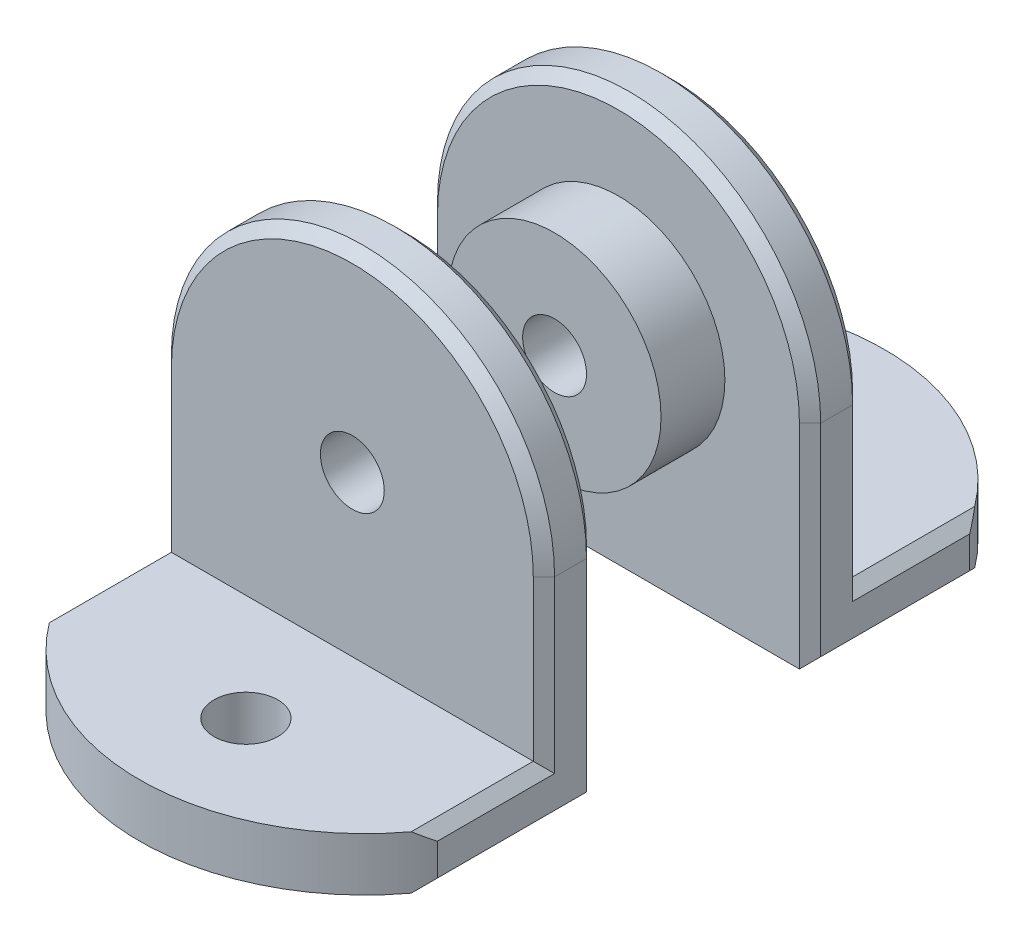
ISO-10303-21;
HEADER;
FILE_DESCRIPTION(('STEP AP214'),'2;1');
FILE_NAME('part.step','',(''),(''),'','','');
FILE_SCHEMA(('AUTOMOTIVE_DESIGN { 1 0 10303 214 1 1 1 1 }'));
ENDSEC;
DATA;
#1=APPLICATION_CONTEXT('core data for automotive mechanical design processes');
#2=APPLICATION_PROTOCOL_DEFINITION('international standard','automotive_design',2000,#1);
#3=PRODUCT_CONTEXT('',#1,'mechanical');
#4=PRODUCT('Part','Part','',(#3));
#5=PRODUCT_RELATED_PRODUCT_CATEGORY('part','',(#4));
#6=PRODUCT_DEFINITION_FORMATION('','',#4);
#7=PRODUCT_DEFINITION_CONTEXT('part definition',#1,'design');
#8=PRODUCT_DEFINITION('design','',#6,#7);
#9=PRODUCT_DEFINITION_SHAPE('','',#8);
#10=(LENGTH_UNIT() NAMED_UNIT(*) SI_UNIT(.MILLI.,.METRE.));
#11=(NAMED_UNIT(*) PLANE_ANGLE_UNIT() SI_UNIT($,.RADIAN.));
#12=(NAMED_UNIT(*) SI_UNIT($,.STERADIAN.) SOLID_ANGLE_UNIT());
#13=UNCERTAINTY_MEASURE_WITH_UNIT(LENGTH_MEASURE(1.E-05),#10,'distance_accuracy_value','');
#14=(GEOMETRIC_REPRESENTATION_CONTEXT(3) GLOBAL_UNCERTAINTY_ASSIGNED_CONTEXT((#13)) GLOBAL_UNIT_ASSIGNED_CONTEXT((#10,
#11,#12)) REPRESENTATION_CONTEXT('',''));
#15=CARTESIAN_POINT('',(0.,0.,0.));
#16=DIRECTION('',(0.,0.,1.));
#17=DIRECTION('',(1.,0.,0.));
#18=AXIS2_PLACEMENT_3D('',#15,#16,#17);
#19=CARTESIAN_POINT('',(0.,0.,-10.));
#20=DIRECTION('',(0.,0.,-1.));
#21=DIRECTION('',(1.,0.,0.));
#22=AXIS2_PLACEMENT_3D('',#19,#20,#21);
#23=PLANE('',#22);
#24=CARTESIAN_POINT('',(0.,0.,-10.));
#25=DIRECTION('',(0.,0.,-1.));
#26=DIRECTION('',(-1.,0.,0.));
#27=AXIS2_PLACEMENT_3D('',#24,#25,#26);
#28=CIRCLE('',#27,17.);
#29=CARTESIAN_POINT('',(17.,0.,-10.));
#30=VERTEX_POINT('',#29);
#31=CARTESIAN_POINT('',(-17.,0.,-10.));
#32=VERTEX_POINT('',#31);
#33=EDGE_CURVE('E62',#30,#32,#28,.F.);
#34=ORIENTED_EDGE('',*,*,#33,.T.);
#35=DIRECTION('',(0.,-1.,0.));
#36=VECTOR('',#35,1.);
#37=CARTESIAN_POINT('',(-17.,0.,-10.));
#38=LINE('',#37,#36);
#39=CARTESIAN_POINT('',(-17.,-20.,-10.));
#40=VERTEX_POINT('',#39);
#41=EDGE_CURVE('E12',#32,#40,#38,.T.);
#42=ORIENTED_EDGE('',*,*,#41,.T.);
#43=DIRECTION('',(1.,0.,0.));
#44=VECTOR('',#43,1.);
#45=CARTESIAN_POINT('',(-18.,-20.,-10.));
#46=LINE('',#45,#44);
#47=CARTESIAN_POINT('',(17.,-20.,-10.));
#48=VERTEX_POINT('',#47);
#49=EDGE_CURVE('E168',#40,#48,#46,.T.);
#50=ORIENTED_EDGE('',*,*,#49,.T.);
#51=DIRECTION('',(0.,1.,0.));
#52=VECTOR('',#51,1.);
#53=CARTESIAN_POINT('',(17.,0.,-10.));
#54=LINE('',#53,#52);
#55=EDGE_CURVE('E73',#48,#30,#54,.T.);
#56=ORIENTED_EDGE('',*,*,#55,.T.);
#57=EDGE_LOOP('',(#34,#42,#50,#56));
#58=FACE_BOUND('',#57,.T.);
#59=CARTESIAN_POINT('',(0.,0.,-10.));
#60=DIRECTION('',(0.,0.,-1.));
#61=DIRECTION('',(-1.,0.,0.));
#62=AXIS2_PLACEMENT_3D('',#59,#60,#61);
#63=CIRCLE('',#62,10.);
#64=CARTESIAN_POINT('',(-10.,0.,-10.));
#65=VERTEX_POINT('',#64);
#66=EDGE_CURVE('E321',#65,#65,#63,.F.);
#67=ORIENTED_EDGE('',*,*,#66,.F.);
#68=EDGE_LOOP('',(#67));
#69=FACE_BOUND('',#68,.T.);
#70=ADVANCED_FACE('F52',(#58,#69),#23,.F.);
#71=CARTESIAN_POINT('',(0.,0.,-15.));
#72=DIRECTION('',(0.,0.,-1.));
#73=DIRECTION('',(1.,0.,0.));
#74=AXIS2_PLACEMENT_3D('',#71,#72,#73);
#75=PLANE('',#74);
#76=DIRECTION('',(-1.,0.,0.));
#77=VECTOR('',#76,1.);
#78=CARTESIAN_POINT('',(0.,-15.,-15.));
#79=LINE('',#78,#77);
#80=CARTESIAN_POINT('',(17.,-15.,-15.));
#81=VERTEX_POINT('',#80);
#82=CARTESIAN_POINT('',(-17.,-15.,-15.));
#83=VERTEX_POINT('',#82);
#84=EDGE_CURVE('E280',#81,#83,#79,.T.);
#85=ORIENTED_EDGE('',*,*,#84,.T.);
#86=DIRECTION('',(0.,1.,0.));
#87=VECTOR('',#86,1.);
#88=CARTESIAN_POINT('',(-17.,0.,-15.));
#89=LINE('',#88,#87);
#90=CARTESIAN_POINT('',(-17.,0.,-15.));
#91=VERTEX_POINT('',#90);
#92=EDGE_CURVE('E223',#83,#91,#89,.T.);
#93=ORIENTED_EDGE('',*,*,#92,.T.);
#94=CARTESIAN_POINT('',(0.,0.,-15.));
#95=DIRECTION('',(0.,0.,-1.));
#96=DIRECTION('',(-1.,0.,0.));
#97=AXIS2_PLACEMENT_3D('',#94,#95,#96);
#98=CIRCLE('',#97,17.);
#99=CARTESIAN_POINT('',(17.,0.,-15.));
#100=VERTEX_POINT('',#99);
#101=EDGE_CURVE('E174',#91,#100,#98,.T.);
#102=ORIENTED_EDGE('',*,*,#101,.T.);
#103=DIRECTION('',(0.,-1.,0.));
#104=VECTOR('',#103,1.);
#105=CARTESIAN_POINT('',(17.,-15.,-15.));
#106=LINE('',#105,#104);
#107=EDGE_CURVE('E218',#100,#81,#106,.T.);
#108=ORIENTED_EDGE('',*,*,#107,.T.);
#109=EDGE_LOOP('',(#85,#93,#102,#108));
#110=FACE_BOUND('',#109,.T.);
#111=CARTESIAN_POINT('',(0.,0.,-15.));
#112=DIRECTION('',(0.,0.,1.));
#113=DIRECTION('',(1.,0.,0.));
#114=AXIS2_PLACEMENT_3D('',#111,#112,#113);
#115=CIRCLE('',#114,3.);
#116=CARTESIAN_POINT('',(3.,0.,-15.));
#117=VERTEX_POINT('',#116);
#118=EDGE_CURVE('E310',#117,#117,#115,.T.);
#119=ORIENTED_EDGE('',*,*,#118,.T.);
#120=EDGE_LOOP('',(#119));
#121=FACE_BOUND('',#120,.T.);
#122=ADVANCED_FACE('F330',(#110,#121),#75,.T.);
#123=CARTESIAN_POINT('',(-18.,-20.,-15.));
#124=DIRECTION('',(1.,0.,0.));
#125=DIRECTION('',(0.,1.,0.));
#126=AXIS2_PLACEMENT_3D('',#123,#124,#125);
#127=PLANE('',#126);
#128=DIRECTION('',(0.,-1.,0.));
#129=VECTOR('',#128,1.);
#130=CARTESIAN_POINT('',(-18.,-15.,-14.));
#131=LINE('',#130,#129);
#132=CARTESIAN_POINT('',(-18.,0.,-14.));
#133=VERTEX_POINT('',#132);
#134=CARTESIAN_POINT('',(-18.,-16.,-14.));
#135=VERTEX_POINT('',#134);
#136=EDGE_CURVE('E162',#133,#135,#131,.T.);
#137=ORIENTED_EDGE('',*,*,#136,.T.);
#138=DIRECTION('',(0.,0.,-1.));
#139=VECTOR('',#138,1.);
#140=CARTESIAN_POINT('',(-18.,-16.,-15.));
#141=LINE('',#140,#139);
#142=CARTESIAN_POINT('',(-18.,-16.,-25.));
#143=VERTEX_POINT('',#142);
#144=EDGE_CURVE('E185',#135,#143,#141,.T.);
#145=ORIENTED_EDGE('',*,*,#144,.T.);
#146=DIRECTION('',(0.,-1.,0.));
#147=VECTOR('',#146,1.);
#148=CARTESIAN_POINT('',(-18.,-15.,-25.));
#149=LINE('',#148,#147);
#150=CARTESIAN_POINT('',(-18.,-19.,-25.));
#151=VERTEX_POINT('',#150);
#152=EDGE_CURVE('E292',#143,#151,#149,.T.);
#153=ORIENTED_EDGE('',*,*,#152,.T.);
#154=DIRECTION('',(0.,0.,1.));
#155=VECTOR('',#154,1.);
#156=CARTESIAN_POINT('',(-18.,-19.,-15.));
#157=LINE('',#156,#155);
#158=CARTESIAN_POINT('',(-18.,-19.,-11.));
#159=VERTEX_POINT('',#158);
#160=EDGE_CURVE('E186',#151,#159,#157,.T.);
#161=ORIENTED_EDGE('',*,*,#160,.T.);
#162=DIRECTION('',(0.,1.,0.));
#163=VECTOR('',#162,1.);
#164=CARTESIAN_POINT('',(-18.,-20.,-11.));
#165=LINE('',#164,#163);
#166=CARTESIAN_POINT('',(-18.,0.,-11.));
#167=VERTEX_POINT('',#166);
#168=EDGE_CURVE('E166',#159,#167,#165,.T.);
#169=ORIENTED_EDGE('',*,*,#168,.T.);
#170=DIRECTION('',(0.,0.,1.));
#171=VECTOR('',#170,1.);
#172=CARTESIAN_POINT('',(-18.,0.,-15.));
#173=LINE('',#172,#171);
#174=EDGE_CURVE('E146',#133,#167,#173,.T.);
#175=ORIENTED_EDGE('',*,*,#174,.F.);
#176=EDGE_LOOP('',(#137,#145,#153,#161,#169,#175));
#177=FACE_BOUND('',#176,.T.);
#178=ADVANCED_FACE('F159',(#177),#127,.F.);
#179=CARTESIAN_POINT('',(-18.,-20.,-15.));
#180=DIRECTION('',(0.,1.,0.));
#181=DIRECTION('',(-1.,0.,0.));
#182=AXIS2_PLACEMENT_3D('',#179,#180,#181);
#183=PLANE('',#182);
#184=ORIENTED_EDGE('',*,*,#49,.F.);
#185=DIRECTION('',(0.,0.,-1.));
#186=VECTOR('',#185,1.);
#187=CARTESIAN_POINT('',(-17.,-20.,-15.));
#188=LINE('',#187,#186);
#189=CARTESIAN_POINT('',(-17.,-20.,-26.4664912268552));
#190=VERTEX_POINT('',#189);
#191=EDGE_CURVE('E197',#40,#190,#188,.T.);
#192=ORIENTED_EDGE('',*,*,#191,.T.);
#193=CARTESIAN_POINT('',(0.,-20.,-13.8));
#194=DIRECTION('',(0.,1.,0.));
#195=DIRECTION('',(1.,0.,0.));
#196=AXIS2_PLACEMENT_3D('',#193,#194,#195);
#197=CIRCLE('',#196,21.2);
#198=CARTESIAN_POINT('',(17.,-20.,-26.4664912268552));
#199=VERTEX_POINT('',#198);
#200=EDGE_CURVE('E295',#190,#199,#197,.F.);
#201=ORIENTED_EDGE('',*,*,#200,.T.);
#202=DIRECTION('',(0.,0.,1.));
#203=VECTOR('',#202,1.);
#204=CARTESIAN_POINT('',(17.,-20.,-15.));
#205=LINE('',#204,#203);
#206=EDGE_CURVE('E190',#199,#48,#205,.T.);
#207=ORIENTED_EDGE('',*,*,#206,.T.);
#208=EDGE_LOOP('',(#184,#192,#201,#207));
#209=FACE_BOUND('',#208,.T.);
#210=CARTESIAN_POINT('',(0.,-20.,-25.));
#211=DIRECTION('',(0.,1.,0.));
#212=DIRECTION('',(1.,0.,0.));
#213=AXIS2_PLACEMENT_3D('',#210,#211,#212);
#214=CIRCLE('',#213,3.);
#215=CARTESIAN_POINT('',(3.,-20.,-25.));
#216=VERTEX_POINT('',#215);
#217=EDGE_CURVE('E299',#216,#216,#214,.T.);
#218=ORIENTED_EDGE('',*,*,#217,.T.);
#219=EDGE_LOOP('',(#218));
#220=FACE_BOUND('',#219,.T.);
#221=ADVANCED_FACE('F346',(#209,#220),#183,.F.);
#222=CARTESIAN_POINT('',(18.,-20.,-15.));
#223=DIRECTION('',(-1.,0.,0.));
#224=DIRECTION('',(0.,-1.,0.));
#225=AXIS2_PLACEMENT_3D('',#222,#223,#224);
#226=PLANE('',#225);
#227=DIRECTION('',(0.,-1.,0.));
#228=VECTOR('',#227,1.);
#229=CARTESIAN_POINT('',(18.,-15.,-25.));
#230=LINE('',#229,#228);
#231=CARTESIAN_POINT('',(18.,-16.,-25.));
#232=VERTEX_POINT('',#231);
#233=CARTESIAN_POINT('',(18.,-19.,-25.));
#234=VERTEX_POINT('',#233);
#235=EDGE_CURVE('E307',#232,#234,#230,.T.);
#236=ORIENTED_EDGE('',*,*,#235,.F.);
#237=DIRECTION('',(0.,0.,1.));
#238=VECTOR('',#237,1.);
#239=CARTESIAN_POINT('',(18.,-16.,-15.));
#240=LINE('',#239,#238);
#241=CARTESIAN_POINT('',(18.,-16.,-14.));
#242=VERTEX_POINT('',#241);
#243=EDGE_CURVE('E236',#232,#242,#240,.T.);
#244=ORIENTED_EDGE('',*,*,#243,.T.);
#245=DIRECTION('',(0.,1.,0.));
#246=VECTOR('',#245,1.);
#247=CARTESIAN_POINT('',(18.,0.,-14.));
#248=LINE('',#247,#246);
#249=CARTESIAN_POINT('',(18.,0.,-14.));
#250=VERTEX_POINT('',#249);
#251=EDGE_CURVE('E233',#242,#250,#248,.T.);
#252=ORIENTED_EDGE('',*,*,#251,.T.);
#253=DIRECTION('',(0.,0.,1.));
#254=VECTOR('',#253,1.);
#255=CARTESIAN_POINT('',(18.,0.,-15.));
#256=LINE('',#255,#254);
#257=CARTESIAN_POINT('',(18.,0.,-11.));
#258=VERTEX_POINT('',#257);
#259=EDGE_CURVE('E149',#250,#258,#256,.T.);
#260=ORIENTED_EDGE('',*,*,#259,.T.);
#261=DIRECTION('',(0.,-1.,0.));
#262=VECTOR('',#261,1.);
#263=CARTESIAN_POINT('',(18.,-20.,-11.));
#264=LINE('',#263,#262);
#265=CARTESIAN_POINT('',(18.,-19.,-11.));
#266=VERTEX_POINT('',#265);
#267=EDGE_CURVE('E155',#258,#266,#264,.T.);
#268=ORIENTED_EDGE('',*,*,#267,.T.);
#269=DIRECTION('',(0.,0.,-1.));
#270=VECTOR('',#269,1.);
#271=CARTESIAN_POINT('',(18.,-19.,-15.));
#272=LINE('',#271,#270);
#273=EDGE_CURVE('E230',#266,#234,#272,.T.);
#274=ORIENTED_EDGE('',*,*,#273,.T.);
#275=EDGE_LOOP('',(#236,#244,#252,#260,#268,#274));
#276=FACE_BOUND('',#275,.T.);
#277=ADVANCED_FACE('F343',(#276),#226,.F.);
#278=CARTESIAN_POINT('',(0.,0.,-15.));
#279=DIRECTION('',(0.,0.,1.));
#280=DIRECTION('',(-1.,0.,0.));
#281=AXIS2_PLACEMENT_3D('',#278,#279,#280);
#282=CYLINDRICAL_SURFACE('',#281,18.);
#283=ORIENTED_EDGE('',*,*,#259,.F.);
#284=CARTESIAN_POINT('',(0.,0.,-14.));
#285=DIRECTION('',(0.,0.,-1.));
#286=DIRECTION('',(-1.,0.,0.));
#287=AXIS2_PLACEMENT_3D('',#284,#285,#286);
#288=CIRCLE('',#287,18.);
#289=EDGE_CURVE('E143',#250,#133,#288,.F.);
#290=ORIENTED_EDGE('',*,*,#289,.T.);
#291=ORIENTED_EDGE('',*,*,#174,.T.);
#292=CARTESIAN_POINT('',(0.,0.,-11.));
#293=DIRECTION('',(0.,0.,-1.));
#294=DIRECTION('',(-1.,0.,0.));
#295=AXIS2_PLACEMENT_3D('',#292,#293,#294);
#296=CIRCLE('',#295,18.);
#297=EDGE_CURVE('E156',#167,#258,#296,.T.);
#298=ORIENTED_EDGE('',*,*,#297,.T.);
#299=EDGE_LOOP('',(#283,#290,#291,#298));
#300=FACE_BOUND('',#299,.T.);
#301=ADVANCED_FACE('F145',(#300),#282,.T.);
#302=CARTESIAN_POINT('',(0.,0.,-15.));
#303=DIRECTION('',(0.,0.,1.));
#304=DIRECTION('',(-1.,0.,0.));
#305=AXIS2_PLACEMENT_3D('',#302,#303,#304);
#306=CYLINDRICAL_SURFACE('',#305,3.);
#307=ORIENTED_EDGE('',*,*,#118,.F.);
#308=EDGE_LOOP('',(#307));
#309=FACE_BOUND('',#308,.T.);
#310=CARTESIAN_POINT('',(0.,0.,-4.));
#311=DIRECTION('',(0.,0.,1.));
#312=DIRECTION('',(1.,0.,0.));
#313=AXIS2_PLACEMENT_3D('',#310,#311,#312);
#314=CIRCLE('',#313,3.);
#315=CARTESIAN_POINT('',(3.,0.,-4.));
#316=VERTEX_POINT('',#315);
#317=EDGE_CURVE('E258',#316,#316,#314,.T.);
#318=ORIENTED_EDGE('',*,*,#317,.T.);
#319=EDGE_LOOP('',(#318));
#320=FACE_BOUND('',#319,.T.);
#321=ADVANCED_FACE('F342',(#309,#320),#306,.F.);
#322=CARTESIAN_POINT('',(0.,-15.,-13.8));
#323=DIRECTION('',(0.,-1.,0.));
#324=DIRECTION('',(1.,0.,0.));
#325=AXIS2_PLACEMENT_3D('',#322,#323,#324);
#326=CYLINDRICAL_SURFACE('',#325,21.2);
#327=ORIENTED_EDGE('',*,*,#200,.F.);
#328=CARTESIAN_POINT('',(0.,-36.9999999999999,-13.8));
#329=DIRECTION('',(0.707106781186545,0.70710678118655,0.));
#330=DIRECTION('',(0.70710678118655,-0.707106781186545,0.));
#331=AXIS2_PLACEMENT_3D('',#328,#329,#330);
#332=ELLIPSE('',#331,29.9813275223095,21.2);
#333=EDGE_CURVE('E209',#190,#151,#332,.T.);
#334=ORIENTED_EDGE('',*,*,#333,.T.);
#335=ORIENTED_EDGE('',*,*,#152,.F.);
#336=CARTESIAN_POINT('',(0.,1.99999999999984,-13.8));
#337=DIRECTION('',(0.707106781186544,-0.707106781186551,0.));
#338=DIRECTION('',(-0.707106781186551,-0.707106781186544,0.));
#339=AXIS2_PLACEMENT_3D('',#336,#337,#338);
#340=ELLIPSE('',#339,29.9813275223095,21.2);
#341=CARTESIAN_POINT('',(-17.,-15.,-26.4664912268552));
#342=VERTEX_POINT('',#341);
#343=EDGE_CURVE('E206',#143,#342,#340,.T.);
#344=ORIENTED_EDGE('',*,*,#343,.T.);
#345=CARTESIAN_POINT('',(0.,-15.,-13.8));
#346=DIRECTION('',(0.,1.,0.));
#347=DIRECTION('',(1.,0.,0.));
#348=AXIS2_PLACEMENT_3D('',#345,#346,#347);
#349=CIRCLE('',#348,21.2);
#350=CARTESIAN_POINT('',(17.,-15.,-26.4664912268552));
#351=VERTEX_POINT('',#350);
#352=EDGE_CURVE('E277',#342,#351,#349,.F.);
#353=ORIENTED_EDGE('',*,*,#352,.T.);
#354=CARTESIAN_POINT('',(0.,1.99999999999991,-13.8));
#355=DIRECTION('',(-0.707106781186546,-0.707106781186549,0.));
#356=DIRECTION('',(0.707106781186549,-0.707106781186546,0.));
#357=AXIS2_PLACEMENT_3D('',#354,#355,#356);
#358=ELLIPSE('',#357,29.9813275223095,21.2);
#359=EDGE_CURVE('E203',#351,#232,#358,.T.);
#360=ORIENTED_EDGE('',*,*,#359,.T.);
#361=ORIENTED_EDGE('',*,*,#235,.T.);
#362=CARTESIAN_POINT('',(0.,-37.0000000000001,-13.8));
#363=DIRECTION('',(-0.70710678118655,0.707106781186545,0.));
#364=DIRECTION('',(-0.707106781186545,-0.70710678118655,0.));
#365=AXIS2_PLACEMENT_3D('',#362,#363,#364);
#366=ELLIPSE('',#365,29.9813275223097,21.2);
#367=EDGE_CURVE('E200',#234,#199,#366,.T.);
#368=ORIENTED_EDGE('',*,*,#367,.T.);
#369=EDGE_LOOP('',(#327,#334,#335,#344,#353,#360,#361,#368));
#370=FACE_BOUND('',#369,.T.);
#371=ADVANCED_FACE('F283',(#370),#326,.T.);
#372=CARTESIAN_POINT('',(0.,-15.,-25.));
#373=DIRECTION('',(0.,-1.,0.));
#374=DIRECTION('',(1.,0.,0.));
#375=AXIS2_PLACEMENT_3D('',#372,#373,#374);
#376=CYLINDRICAL_SURFACE('',#375,3.);
#377=CARTESIAN_POINT('',(0.,-15.,-25.));
#378=DIRECTION('',(0.,1.,0.));
#379=DIRECTION('',(1.,0.,0.));
#380=AXIS2_PLACEMENT_3D('',#377,#378,#379);
#381=CIRCLE('',#380,3.);
#382=CARTESIAN_POINT('',(3.,-15.,-25.));
#383=VERTEX_POINT('',#382);
#384=EDGE_CURVE('E288',#383,#383,#381,.T.);
#385=ORIENTED_EDGE('',*,*,#384,.T.);
#386=EDGE_LOOP('',(#385));
#387=FACE_BOUND('',#386,.T.);
#388=ORIENTED_EDGE('',*,*,#217,.F.);
#389=EDGE_LOOP('',(#388));
#390=FACE_BOUND('',#389,.T.);
#391=ADVANCED_FACE('F428',(#387,#390),#376,.F.);
#392=CARTESIAN_POINT('',(0.,-15.,-10.));
#393=DIRECTION('',(0.,-1.,0.));
#394=DIRECTION('',(1.,0.,0.));
#395=AXIS2_PLACEMENT_3D('',#392,#393,#394);
#396=PLANE('',#395);
#397=ORIENTED_EDGE('',*,*,#384,.F.);
#398=EDGE_LOOP('',(#397));
#399=FACE_BOUND('',#398,.T.);
#400=ORIENTED_EDGE('',*,*,#352,.F.);
#401=DIRECTION('',(0.,0.,1.));
#402=VECTOR('',#401,1.);
#403=CARTESIAN_POINT('',(-17.,-15.,-10.));
#404=LINE('',#403,#402);
#405=EDGE_CURVE('E215',#342,#83,#404,.T.);
#406=ORIENTED_EDGE('',*,*,#405,.T.);
#407=ORIENTED_EDGE('',*,*,#84,.F.);
#408=DIRECTION('',(0.,0.,-1.));
#409=VECTOR('',#408,1.);
#410=CARTESIAN_POINT('',(17.,-15.,-10.));
#411=LINE('',#410,#409);
#412=EDGE_CURVE('E212',#81,#351,#411,.T.);
#413=ORIENTED_EDGE('',*,*,#412,.T.);
#414=EDGE_LOOP('',(#400,#406,#407,#413));
#415=FACE_BOUND('',#414,.T.);
#416=ADVANCED_FACE('F276',(#399,#415),#396,.F.);
#417=CARTESIAN_POINT('',(0.,0.,-4.));
#418=DIRECTION('',(0.,0.,1.));
#419=DIRECTION('',(1.,0.,0.));
#420=AXIS2_PLACEMENT_3D('',#417,#418,#419);
#421=PLANE('',#420);
#422=CARTESIAN_POINT('',(0.,0.,-4.));
#423=DIRECTION('',(0.,0.,1.));
#424=DIRECTION('',(1.,0.,0.));
#425=AXIS2_PLACEMENT_3D('',#422,#423,#424);
#426=CIRCLE('',#425,10.);
#427=CARTESIAN_POINT('',(10.,0.,-4.));
#428=VERTEX_POINT('',#427);
#429=EDGE_CURVE('E303',#428,#428,#426,.T.);
#430=ORIENTED_EDGE('',*,*,#429,.T.);
#431=EDGE_LOOP('',(#430));
#432=FACE_BOUND('',#431,.T.);
#433=ORIENTED_EDGE('',*,*,#317,.F.);
#434=EDGE_LOOP('',(#433));
#435=FACE_BOUND('',#434,.T.);
#436=ADVANCED_FACE('F412',(#432,#435),#421,.T.);
#437=CARTESIAN_POINT('',(0.,0.,-4.));
#438=DIRECTION('',(0.,0.,-1.));
#439=DIRECTION('',(-1.,0.,0.));
#440=AXIS2_PLACEMENT_3D('',#437,#438,#439);
#441=CYLINDRICAL_SURFACE('',#440,10.);
#442=ORIENTED_EDGE('',*,*,#429,.F.);
#443=EDGE_LOOP('',(#442));
#444=FACE_BOUND('',#443,.T.);
#445=ORIENTED_EDGE('',*,*,#66,.T.);
#446=EDGE_LOOP('',(#445));
#447=FACE_BOUND('',#446,.T.);
#448=ADVANCED_FACE('F327',(#444,#447),#441,.T.);
#449=CARTESIAN_POINT('',(17.,-20.,-15.));
#450=DIRECTION('',(-0.70710678118655,0.707106781186545,0.));
#451=DIRECTION('',(0.,0.,1.));
#452=AXIS2_PLACEMENT_3D('',#449,#450,#451);
#453=PLANE('',#452);
#454=ORIENTED_EDGE('',*,*,#367,.F.);
#455=ORIENTED_EDGE('',*,*,#273,.F.);
#456=DIRECTION('',(0.577350269189623,0.577350269189627,-0.577350269189627));
#457=VECTOR('',#456,1.);
#458=CARTESIAN_POINT('',(23.6666666666667,-13.3333333333333,-16.6666666666667));
#459=LINE('',#458,#457);
#460=EDGE_CURVE('E254',#48,#266,#459,.T.);
#461=ORIENTED_EDGE('',*,*,#460,.F.);
#462=ORIENTED_EDGE('',*,*,#206,.F.);
#463=EDGE_LOOP('',(#454,#455,#461,#462));
#464=FACE_BOUND('',#463,.T.);
#465=ADVANCED_FACE('F368',(#464),#453,.F.);
#466=CARTESIAN_POINT('',(17.,0.,-10.));
#467=DIRECTION('',(-0.70710678118655,0.,-0.707106781186545));
#468=DIRECTION('',(0.,1.,0.));
#469=AXIS2_PLACEMENT_3D('',#466,#467,#468);
#470=PLANE('',#469);
#471=ORIENTED_EDGE('',*,*,#460,.T.);
#472=ORIENTED_EDGE('',*,*,#267,.F.);
#473=DIRECTION('',(0.707106781186545,0.,-0.70710678118655));
#474=VECTOR('',#473,1.);
#475=CARTESIAN_POINT('',(17.,0.,-10.));
#476=LINE('',#475,#474);
#477=EDGE_CURVE('E250',#30,#258,#476,.T.);
#478=ORIENTED_EDGE('',*,*,#477,.F.);
#479=ORIENTED_EDGE('',*,*,#55,.F.);
#480=EDGE_LOOP('',(#471,#472,#478,#479));
#481=FACE_BOUND('',#480,.T.);
#482=ADVANCED_FACE('F364',(#481),#470,.F.);
#483=CARTESIAN_POINT('',(0.,0.,-10.));
#484=DIRECTION('',(0.,0.,-1.));
#485=DIRECTION('',(-1.,0.,0.));
#486=AXIS2_PLACEMENT_3D('',#483,#484,#485);
#487=CONICAL_SURFACE('',#486,17.,0.785398163397445);
#488=ORIENTED_EDGE('',*,*,#477,.T.);
#489=ORIENTED_EDGE('',*,*,#297,.F.);
#490=DIRECTION('',(-0.707106781186545,0.,-0.70710678118655));
#491=VECTOR('',#490,1.);
#492=CARTESIAN_POINT('',(-17.,0.,-10.));
#493=LINE('',#492,#491);
#494=EDGE_CURVE('E246',#32,#167,#493,.T.);
#495=ORIENTED_EDGE('',*,*,#494,.F.);
#496=ORIENTED_EDGE('',*,*,#33,.F.);
#497=EDGE_LOOP('',(#488,#489,#495,#496));
#498=FACE_BOUND('',#497,.T.);
#499=ADVANCED_FACE('F360',(#498),#487,.T.);
#500=CARTESIAN_POINT('',(-17.,0.,-10.));
#501=DIRECTION('',(0.70710678118655,0.,-0.707106781186545));
#502=DIRECTION('',(0.,-1.,0.));
#503=AXIS2_PLACEMENT_3D('',#500,#501,#502);
#504=PLANE('',#503);
#505=ORIENTED_EDGE('',*,*,#494,.T.);
#506=ORIENTED_EDGE('',*,*,#168,.F.);
#507=DIRECTION('',(0.577350269189626,-0.577350269189622,0.57735026918963));
#508=VECTOR('',#507,1.);
#509=CARTESIAN_POINT('',(-23.6666666666666,-13.3333333333334,-16.6666666666667));
#510=LINE('',#509,#508);
#511=EDGE_CURVE('E243',#40,#159,#510,.F.);
#512=ORIENTED_EDGE('',*,*,#511,.F.);
#513=ORIENTED_EDGE('',*,*,#41,.F.);
#514=EDGE_LOOP('',(#505,#506,#512,#513));
#515=FACE_BOUND('',#514,.T.);
#516=ADVANCED_FACE('F356',(#515),#504,.F.);
#517=CARTESIAN_POINT('',(-18.,-19.,-15.));
#518=DIRECTION('',(0.707106781186545,0.70710678118655,0.));
#519=DIRECTION('',(0.,0.,1.));
#520=AXIS2_PLACEMENT_3D('',#517,#518,#519);
#521=PLANE('',#520);
#522=ORIENTED_EDGE('',*,*,#333,.F.);
#523=ORIENTED_EDGE('',*,*,#191,.F.);
#524=ORIENTED_EDGE('',*,*,#511,.T.);
#525=ORIENTED_EDGE('',*,*,#160,.F.);
#526=EDGE_LOOP('',(#522,#523,#524,#525));
#527=FACE_BOUND('',#526,.T.);
#528=ADVANCED_FACE('F353',(#527),#521,.F.);
#529=CARTESIAN_POINT('',(17.,-15.,-10.));
#530=DIRECTION('',(-0.707106781186546,-0.707106781186549,0.));
#531=DIRECTION('',(0.,0.,-1.));
#532=AXIS2_PLACEMENT_3D('',#529,#530,#531);
#533=PLANE('',#532);
#534=ORIENTED_EDGE('',*,*,#359,.F.);
#535=ORIENTED_EDGE('',*,*,#412,.F.);
#536=DIRECTION('',(0.577350269189628,-0.577350269189625,0.577350269189624));
#537=VECTOR('',#536,1.);
#538=CARTESIAN_POINT('',(18.6666666666667,-16.6666666666667,-13.3333333333333));
#539=LINE('',#538,#537);
#540=EDGE_CURVE('E56',#242,#81,#539,.F.);
#541=ORIENTED_EDGE('',*,*,#540,.F.);
#542=ORIENTED_EDGE('',*,*,#243,.F.);
#543=EDGE_LOOP('',(#534,#535,#541,#542));
#544=FACE_BOUND('',#543,.T.);
#545=ADVANCED_FACE('F54',(#544),#533,.F.);
#546=CARTESIAN_POINT('',(18.,-20.,-14.));
#547=DIRECTION('',(0.707106781186545,0.,-0.70710678118655));
#548=DIRECTION('',(0.,-1.,0.));
#549=AXIS2_PLACEMENT_3D('',#546,#547,#548);
#550=PLANE('',#549);
#551=ORIENTED_EDGE('',*,*,#540,.T.);
#552=ORIENTED_EDGE('',*,*,#107,.F.);
#553=DIRECTION('',(-0.70710678118655,0.,-0.707106781186545));
#554=VECTOR('',#553,1.);
#555=CARTESIAN_POINT('',(18.,0.,-14.));
#556=LINE('',#555,#554);
#557=EDGE_CURVE('E178',#250,#100,#556,.T.);
#558=ORIENTED_EDGE('',*,*,#557,.F.);
#559=ORIENTED_EDGE('',*,*,#251,.F.);
#560=EDGE_LOOP('',(#551,#552,#558,#559));
#561=FACE_BOUND('',#560,.T.);
#562=ADVANCED_FACE('F267',(#561),#550,.T.);
#563=CARTESIAN_POINT('',(0.,0.,-14.));
#564=DIRECTION('',(0.,0.,1.));
#565=DIRECTION('',(1.,0.,0.));
#566=AXIS2_PLACEMENT_3D('',#563,#564,#565);
#567=CONICAL_SURFACE('',#566,18.,0.785398163397452);
#568=ORIENTED_EDGE('',*,*,#557,.T.);
#569=ORIENTED_EDGE('',*,*,#101,.F.);
#570=DIRECTION('',(0.70710678118655,0.,-0.707106781186545));
#571=VECTOR('',#570,1.);
#572=CARTESIAN_POINT('',(-18.,0.,-14.));
#573=LINE('',#572,#571);
#574=EDGE_CURVE('E172',#133,#91,#573,.T.);
#575=ORIENTED_EDGE('',*,*,#574,.F.);
#576=ORIENTED_EDGE('',*,*,#289,.F.);
#577=EDGE_LOOP('',(#568,#569,#575,#576));
#578=FACE_BOUND('',#577,.T.);
#579=ADVANCED_FACE('F173',(#578),#567,.T.);
#580=CARTESIAN_POINT('',(-18.,-20.,-14.));
#581=DIRECTION('',(-0.707106781186545,0.,-0.70710678118655));
#582=DIRECTION('',(0.,1.,0.));
#583=AXIS2_PLACEMENT_3D('',#580,#581,#582);
#584=PLANE('',#583);
#585=ORIENTED_EDGE('',*,*,#574,.T.);
#586=ORIENTED_EDGE('',*,*,#92,.F.);
#587=DIRECTION('',(0.577350269189629,0.577350269189624,-0.577350269189625));
#588=VECTOR('',#587,1.);
#589=CARTESIAN_POINT('',(-17.6666666666667,-15.6666666666667,-14.3333333333333));
#590=LINE('',#589,#588);
#591=EDGE_CURVE('E179',#135,#83,#590,.T.);
#592=ORIENTED_EDGE('',*,*,#591,.F.);
#593=ORIENTED_EDGE('',*,*,#136,.F.);
#594=EDGE_LOOP('',(#585,#586,#592,#593));
#595=FACE_BOUND('',#594,.T.);
#596=ADVANCED_FACE('F181',(#595),#584,.T.);
#597=CARTESIAN_POINT('',(-18.,-16.,-15.));
#598=DIRECTION('',(0.707106781186544,-0.707106781186551,0.));
#599=DIRECTION('',(0.,0.,-1.));
#600=AXIS2_PLACEMENT_3D('',#597,#598,#599);
#601=PLANE('',#600);
#602=ORIENTED_EDGE('',*,*,#591,.T.);
#603=ORIENTED_EDGE('',*,*,#405,.F.);
#604=ORIENTED_EDGE('',*,*,#343,.F.);
#605=ORIENTED_EDGE('',*,*,#144,.F.);
#606=EDGE_LOOP('',(#602,#603,#604,#605));
#607=FACE_BOUND('',#606,.T.);
#608=ADVANCED_FACE('F373',(#607),#601,.F.);
#609=CLOSED_SHELL('',(#70,#122,#178,#221,#277,#301,#321,#371,#391,#416,#436,#448,#465,#482,#499,
#516,#528,#545,#562,#579,#596,#608));
#610=MANIFOLD_SOLID_BREP('B2',#609);
#611=CARTESIAN_POINT('',(0.,0.,15.));
#612=DIRECTION('',(0.,0.,1.));
#613=DIRECTION('',(1.,0.,0.));
#614=AXIS2_PLACEMENT_3D('',#611,#612,#613);
#615=PLANE('',#614);
#616=CARTESIAN_POINT('',(0.,0.,15.));
#617=DIRECTION('',(0.,0.,1.));
#618=DIRECTION('',(1.,0.,0.));
#619=AXIS2_PLACEMENT_3D('',#616,#617,#618);
#620=CIRCLE('',#619,17.);
#621=CARTESIAN_POINT('',(17.,0.,15.));
#622=VERTEX_POINT('',#621);
#623=CARTESIAN_POINT('',(-17.,0.,15.));
#624=VERTEX_POINT('',#623);
#625=EDGE_CURVE('E591',#622,#624,#620,.T.);
#626=ORIENTED_EDGE('',*,*,#625,.T.);
#627=DIRECTION('',(0.,-1.,0.));
#628=VECTOR('',#627,1.);
#629=CARTESIAN_POINT('',(-17.,-15.,15.));
#630=LINE('',#629,#628);
#631=CARTESIAN_POINT('',(-17.,-15.,15.));
#632=VERTEX_POINT('',#631);
#633=EDGE_CURVE('E50',#624,#632,#630,.T.);
#634=ORIENTED_EDGE('',*,*,#633,.T.);
#635=DIRECTION('',(-1.,0.,0.));
#636=VECTOR('',#635,1.);
#637=CARTESIAN_POINT('',(0.,-15.,15.));
#638=LINE('',#637,#636);
#639=CARTESIAN_POINT('',(17.,-15.,15.));
#640=VERTEX_POINT('',#639);
#641=EDGE_CURVE('E690',#640,#632,#638,.T.);
#642=ORIENTED_EDGE('',*,*,#641,.F.);
#643=DIRECTION('',(0.,1.,0.));
#644=VECTOR('',#643,1.);
#645=CARTESIAN_POINT('',(17.,0.,15.));
#646=LINE('',#645,#644);
#647=EDGE_CURVE('E602',#640,#622,#646,.T.);
#648=ORIENTED_EDGE('',*,*,#647,.T.);
#649=EDGE_LOOP('',(#626,#634,#642,#648));
#650=FACE_BOUND('',#649,.T.);
#651=CARTESIAN_POINT('',(0.,0.,15.));
#652=DIRECTION('',(0.,0.,1.));
#653=DIRECTION('',(1.,0.,0.));
#654=AXIS2_PLACEMENT_3D('',#651,#652,#653);
#655=CIRCLE('',#654,3.);
#656=CARTESIAN_POINT('',(3.,0.,15.));
#657=VERTEX_POINT('',#656);
#658=EDGE_CURVE('E717',#657,#657,#655,.T.);
#659=ORIENTED_EDGE('',*,*,#658,.F.);
#660=EDGE_LOOP('',(#659));
#661=FACE_BOUND('',#660,.T.);
#662=ADVANCED_FACE('F582',(#650,#661),#615,.T.);
#663=CARTESIAN_POINT('',(0.,0.,10.));
#664=DIRECTION('',(0.,0.,1.));
#665=DIRECTION('',(1.,0.,0.));
#666=AXIS2_PLACEMENT_3D('',#663,#664,#665);
#667=PLANE('',#666);
#668=DIRECTION('',(1.,0.,0.));
#669=VECTOR('',#668,1.);
#670=CARTESIAN_POINT('',(-18.,-20.,10.));
#671=LINE('',#670,#669);
#672=CARTESIAN_POINT('',(-17.,-20.,10.));
#673=VERTEX_POINT('',#672);
#674=CARTESIAN_POINT('',(17.,-20.,10.));
#675=VERTEX_POINT('',#674);
#676=EDGE_CURVE('E720',#673,#675,#671,.T.);
#677=ORIENTED_EDGE('',*,*,#676,.F.);
#678=DIRECTION('',(0.,1.,0.));
#679=VECTOR('',#678,1.);
#680=CARTESIAN_POINT('',(-17.,0.,10.));
#681=LINE('',#680,#679);
#682=CARTESIAN_POINT('',(-17.,0.,10.));
#683=VERTEX_POINT('',#682);
#684=EDGE_CURVE('E751',#673,#683,#681,.T.);
#685=ORIENTED_EDGE('',*,*,#684,.T.);
#686=CARTESIAN_POINT('',(0.,0.,10.));
#687=DIRECTION('',(0.,0.,1.));
#688=DIRECTION('',(1.,0.,0.));
#689=AXIS2_PLACEMENT_3D('',#686,#687,#688);
#690=CIRCLE('',#689,17.);
#691=CARTESIAN_POINT('',(17.,0.,10.));
#692=VERTEX_POINT('',#691);
#693=EDGE_CURVE('E749',#683,#692,#690,.F.);
#694=ORIENTED_EDGE('',*,*,#693,.T.);
#695=DIRECTION('',(0.,-1.,0.));
#696=VECTOR('',#695,1.);
#697=CARTESIAN_POINT('',(17.,0.,10.));
#698=LINE('',#697,#696);
#699=EDGE_CURVE('E747',#692,#675,#698,.T.);
#700=ORIENTED_EDGE('',*,*,#699,.T.);
#701=EDGE_LOOP('',(#677,#685,#694,#700));
#702=FACE_BOUND('',#701,.T.);
#703=CARTESIAN_POINT('',(0.,0.,10.));
#704=DIRECTION('',(0.,0.,1.));
#705=DIRECTION('',(1.,0.,0.));
#706=AXIS2_PLACEMENT_3D('',#703,#704,#705);
#707=CIRCLE('',#706,3.);
#708=CARTESIAN_POINT('',(3.,0.,10.));
#709=VERTEX_POINT('',#708);
#710=EDGE_CURVE('E715',#709,#709,#707,.T.);
#711=ORIENTED_EDGE('',*,*,#710,.T.);
#712=EDGE_LOOP('',(#711));
#713=FACE_BOUND('',#712,.T.);
#714=ADVANCED_FACE('F810',(#702,#713),#667,.F.);
#715=CARTESIAN_POINT('',(-18.,-20.,15.));
#716=DIRECTION('',(1.,0.,0.));
#717=DIRECTION('',(0.,1.,0.));
#718=AXIS2_PLACEMENT_3D('',#715,#716,#717);
#719=PLANE('',#718);
#720=DIRECTION('',(0.,-1.,0.));
#721=VECTOR('',#720,1.);
#722=CARTESIAN_POINT('',(-18.,-20.,11.));
#723=LINE('',#722,#721);
#724=CARTESIAN_POINT('',(-18.,0.,11.));
#725=VERTEX_POINT('',#724);
#726=CARTESIAN_POINT('',(-18.,-19.,11.));
#727=VERTEX_POINT('',#726);
#728=EDGE_CURVE('E738',#725,#727,#723,.T.);
#729=ORIENTED_EDGE('',*,*,#728,.T.);
#730=DIRECTION('',(0.,0.,1.));
#731=VECTOR('',#730,1.);
#732=CARTESIAN_POINT('',(-18.,-19.,15.));
#733=LINE('',#732,#731);
#734=CARTESIAN_POINT('',(-18.,-19.,25.));
#735=VERTEX_POINT('',#734);
#736=EDGE_CURVE('E740',#727,#735,#733,.T.);
#737=ORIENTED_EDGE('',*,*,#736,.T.);
#738=DIRECTION('',(0.,-1.,0.));
#739=VECTOR('',#738,1.);
#740=CARTESIAN_POINT('',(-18.,-15.,25.));
#741=LINE('',#740,#739);
#742=CARTESIAN_POINT('',(-18.,-16.,25.));
#743=VERTEX_POINT('',#742);
#744=EDGE_CURVE('E700',#743,#735,#741,.T.);
#745=ORIENTED_EDGE('',*,*,#744,.F.);
#746=DIRECTION('',(0.,0.,-1.));
#747=VECTOR('',#746,1.);
#748=CARTESIAN_POINT('',(-18.,-16.,15.));
#749=LINE('',#748,#747);
#750=CARTESIAN_POINT('',(-18.,-16.,14.));
#751=VERTEX_POINT('',#750);
#752=EDGE_CURVE('E676',#743,#751,#749,.T.);
#753=ORIENTED_EDGE('',*,*,#752,.T.);
#754=DIRECTION('',(0.,1.,0.));
#755=VECTOR('',#754,1.);
#756=CARTESIAN_POINT('',(-18.,0.,14.));
#757=LINE('',#756,#755);
#758=CARTESIAN_POINT('',(-18.,0.,14.));
#759=VERTEX_POINT('',#758);
#760=EDGE_CURVE('E681',#751,#759,#757,.T.);
#761=ORIENTED_EDGE('',*,*,#760,.T.);
#762=DIRECTION('',(0.,0.,-1.));
#763=VECTOR('',#762,1.);
#764=CARTESIAN_POINT('',(-18.,0.,15.));
#765=LINE('',#764,#763);
#766=EDGE_CURVE('E725',#759,#725,#765,.T.);
#767=ORIENTED_EDGE('',*,*,#766,.T.);
#768=EDGE_LOOP('',(#729,#737,#745,#753,#761,#767));
#769=FACE_BOUND('',#768,.T.);
#770=ADVANCED_FACE('F818',(#769),#719,.F.);
#771=CARTESIAN_POINT('',(-18.,-20.,15.));
#772=DIRECTION('',(0.,1.,0.));
#773=DIRECTION('',(-1.,0.,0.));
#774=AXIS2_PLACEMENT_3D('',#771,#772,#773);
#775=PLANE('',#774);
#776=CARTESIAN_POINT('',(0.,-20.,13.8));
#777=DIRECTION('',(0.,-1.,0.));
#778=DIRECTION('',(1.,0.,0.));
#779=AXIS2_PLACEMENT_3D('',#776,#777,#778);
#780=CIRCLE('',#779,21.2);
#781=CARTESIAN_POINT('',(-17.,-20.,26.4664912268552));
#782=VERTEX_POINT('',#781);
#783=CARTESIAN_POINT('',(17.,-20.,26.4664912268552));
#784=VERTEX_POINT('',#783);
#785=EDGE_CURVE('E703',#782,#784,#780,.F.);
#786=ORIENTED_EDGE('',*,*,#785,.F.);
#787=DIRECTION('',(0.,0.,-1.));
#788=VECTOR('',#787,1.);
#789=CARTESIAN_POINT('',(-17.,-20.,15.));
#790=LINE('',#789,#788);
#791=EDGE_CURVE('E744',#782,#673,#790,.T.);
#792=ORIENTED_EDGE('',*,*,#791,.T.);
#793=ORIENTED_EDGE('',*,*,#676,.T.);
#794=DIRECTION('',(0.,0.,1.));
#795=VECTOR('',#794,1.);
#796=CARTESIAN_POINT('',(17.,-20.,15.));
#797=LINE('',#796,#795);
#798=EDGE_CURVE('E742',#675,#784,#797,.T.);
#799=ORIENTED_EDGE('',*,*,#798,.T.);
#800=EDGE_LOOP('',(#786,#792,#793,#799));
#801=FACE_BOUND('',#800,.T.);
#802=CARTESIAN_POINT('',(0.,-20.,25.));
#803=DIRECTION('',(0.,-1.,0.));
#804=DIRECTION('',(1.,0.,0.));
#805=AXIS2_PLACEMENT_3D('',#802,#803,#804);
#806=CIRCLE('',#805,3.);
#807=CARTESIAN_POINT('',(3.,-20.,25.));
#808=VERTEX_POINT('',#807);
#809=EDGE_CURVE('E706',#808,#808,#806,.T.);
#810=ORIENTED_EDGE('',*,*,#809,.F.);
#811=EDGE_LOOP('',(#810));
#812=FACE_BOUND('',#811,.T.);
#813=ADVANCED_FACE('F799',(#801,#812),#775,.F.);
#814=CARTESIAN_POINT('',(18.,-20.,15.));
#815=DIRECTION('',(-1.,0.,0.));
#816=DIRECTION('',(0.,-1.,0.));
#817=AXIS2_PLACEMENT_3D('',#814,#815,#816);
#818=PLANE('',#817);
#819=DIRECTION('',(0.,-1.,0.));
#820=VECTOR('',#819,1.);
#821=CARTESIAN_POINT('',(18.,-15.,25.));
#822=LINE('',#821,#820);
#823=CARTESIAN_POINT('',(18.,-16.,25.));
#824=VERTEX_POINT('',#823);
#825=CARTESIAN_POINT('',(18.,-19.,25.));
#826=VERTEX_POINT('',#825);
#827=EDGE_CURVE('E712',#824,#826,#822,.T.);
#828=ORIENTED_EDGE('',*,*,#827,.T.);
#829=DIRECTION('',(0.,0.,-1.));
#830=VECTOR('',#829,1.);
#831=CARTESIAN_POINT('',(18.,-19.,15.));
#832=LINE('',#831,#830);
#833=CARTESIAN_POINT('',(18.,-19.,11.));
#834=VERTEX_POINT('',#833);
#835=EDGE_CURVE('E763',#826,#834,#832,.T.);
#836=ORIENTED_EDGE('',*,*,#835,.T.);
#837=DIRECTION('',(0.,1.,0.));
#838=VECTOR('',#837,1.);
#839=CARTESIAN_POINT('',(18.,-20.,11.));
#840=LINE('',#839,#838);
#841=CARTESIAN_POINT('',(18.,0.,11.));
#842=VERTEX_POINT('',#841);
#843=EDGE_CURVE('E761',#834,#842,#840,.T.);
#844=ORIENTED_EDGE('',*,*,#843,.T.);
#845=DIRECTION('',(0.,0.,-1.));
#846=VECTOR('',#845,1.);
#847=CARTESIAN_POINT('',(18.,0.,15.));
#848=LINE('',#847,#846);
#849=CARTESIAN_POINT('',(18.,0.,14.));
#850=VERTEX_POINT('',#849);
#851=EDGE_CURVE('E728',#850,#842,#848,.T.);
#852=ORIENTED_EDGE('',*,*,#851,.F.);
#853=DIRECTION('',(0.,-1.,0.));
#854=VECTOR('',#853,1.);
#855=CARTESIAN_POINT('',(18.,-15.,14.));
#856=LINE('',#855,#854);
#857=CARTESIAN_POINT('',(18.,-16.,14.));
#858=VERTEX_POINT('',#857);
#859=EDGE_CURVE('E757',#850,#858,#856,.T.);
#860=ORIENTED_EDGE('',*,*,#859,.T.);
#861=DIRECTION('',(0.,0.,1.));
#862=VECTOR('',#861,1.);
#863=CARTESIAN_POINT('',(18.,-16.,15.));
#864=LINE('',#863,#862);
#865=EDGE_CURVE('E759',#858,#824,#864,.T.);
#866=ORIENTED_EDGE('',*,*,#865,.T.);
#867=EDGE_LOOP('',(#828,#836,#844,#852,#860,#866));
#868=FACE_BOUND('',#867,.T.);
#869=ADVANCED_FACE('F839',(#868),#818,.F.);
#870=CARTESIAN_POINT('',(0.,0.,15.));
#871=DIRECTION('',(0.,0.,-1.));
#872=DIRECTION('',(-1.,0.,0.));
#873=AXIS2_PLACEMENT_3D('',#870,#871,#872);
#874=CYLINDRICAL_SURFACE('',#873,18.);
#875=ORIENTED_EDGE('',*,*,#851,.T.);
#876=CARTESIAN_POINT('',(0.,0.,11.));
#877=DIRECTION('',(0.,0.,1.));
#878=DIRECTION('',(1.,0.,0.));
#879=AXIS2_PLACEMENT_3D('',#876,#877,#878);
#880=CIRCLE('',#879,18.);
#881=EDGE_CURVE('E755',#842,#725,#880,.T.);
#882=ORIENTED_EDGE('',*,*,#881,.T.);
#883=ORIENTED_EDGE('',*,*,#766,.F.);
#884=CARTESIAN_POINT('',(0.,0.,14.));
#885=DIRECTION('',(0.,0.,1.));
#886=DIRECTION('',(1.,0.,0.));
#887=AXIS2_PLACEMENT_3D('',#884,#885,#886);
#888=CIRCLE('',#887,18.);
#889=EDGE_CURVE('E753',#759,#850,#888,.F.);
#890=ORIENTED_EDGE('',*,*,#889,.T.);
#891=EDGE_LOOP('',(#875,#882,#883,#890));
#892=FACE_BOUND('',#891,.T.);
#893=ADVANCED_FACE('F823',(#892),#874,.T.);
#894=CARTESIAN_POINT('',(0.,0.,15.));
#895=DIRECTION('',(0.,0.,-1.));
#896=DIRECTION('',(-1.,0.,0.));
#897=AXIS2_PLACEMENT_3D('',#894,#895,#896);
#898=CYLINDRICAL_SURFACE('',#897,3.);
#899=ORIENTED_EDGE('',*,*,#658,.T.);
#900=EDGE_LOOP('',(#899));
#901=FACE_BOUND('',#900,.T.);
#902=ORIENTED_EDGE('',*,*,#710,.F.);
#903=EDGE_LOOP('',(#902));
#904=FACE_BOUND('',#903,.T.);
#905=ADVANCED_FACE('F846',(#901,#904),#898,.F.);
#906=CARTESIAN_POINT('',(0.,-15.,13.8));
#907=DIRECTION('',(0.,-1.,0.));
#908=DIRECTION('',(1.,0.,0.));
#909=AXIS2_PLACEMENT_3D('',#906,#907,#908);
#910=CYLINDRICAL_SURFACE('',#909,21.2);
#911=CARTESIAN_POINT('',(0.,-15.,13.8));
#912=DIRECTION('',(0.,-1.,0.));
#913=DIRECTION('',(1.,0.,0.));
#914=AXIS2_PLACEMENT_3D('',#911,#912,#913);
#915=CIRCLE('',#914,21.2);
#916=CARTESIAN_POINT('',(-17.,-15.,26.4664912268552));
#917=VERTEX_POINT('',#916);
#918=CARTESIAN_POINT('',(17.,-15.,26.4664912268552));
#919=VERTEX_POINT('',#918);
#920=EDGE_CURVE('E688',#917,#919,#915,.F.);
#921=ORIENTED_EDGE('',*,*,#920,.F.);
#922=CARTESIAN_POINT('',(0.,2.00000000000006,13.8));
#923=DIRECTION('',(0.707106781186549,-0.707106781186546,0.));
#924=DIRECTION('',(-0.707106781186546,-0.707106781186549,0.));
#925=AXIS2_PLACEMENT_3D('',#922,#923,#924);
#926=ELLIPSE('',#925,29.9813275223097,21.2);
#927=EDGE_CURVE('E671',#917,#743,#926,.T.);
#928=ORIENTED_EDGE('',*,*,#927,.T.);
#929=ORIENTED_EDGE('',*,*,#744,.T.);
#930=CARTESIAN_POINT('',(0.,-37.0000000000001,13.8));
#931=DIRECTION('',(0.70710678118655,0.707106781186545,0.));
#932=DIRECTION('',(0.707106781186545,-0.70710678118655,0.));
#933=AXIS2_PLACEMENT_3D('',#930,#931,#932);
#934=ELLIPSE('',#933,29.9813275223097,21.2);
#935=EDGE_CURVE('E682',#735,#782,#934,.T.);
#936=ORIENTED_EDGE('',*,*,#935,.T.);
#937=ORIENTED_EDGE('',*,*,#785,.T.);
#938=CARTESIAN_POINT('',(0.,-37.,13.8));
#939=DIRECTION('',(-0.707106781186547,0.707106781186547,0.));
#940=DIRECTION('',(-0.707106781186548,-0.707106781186548,0.));
#941=AXIS2_PLACEMENT_3D('',#938,#939,#940);
#942=ELLIPSE('',#941,29.9813275223096,21.2);
#943=EDGE_CURVE('E733',#784,#826,#942,.T.);
#944=ORIENTED_EDGE('',*,*,#943,.T.);
#945=ORIENTED_EDGE('',*,*,#827,.F.);
#946=CARTESIAN_POINT('',(0.,2.00000000000015,13.8));
#947=DIRECTION('',(-0.707106781186551,-0.707106781186545,0.));
#948=DIRECTION('',(0.707106781186545,-0.707106781186551,0.));
#949=AXIS2_PLACEMENT_3D('',#946,#947,#948);
#950=ELLIPSE('',#949,29.9813275223097,21.2);
#951=EDGE_CURVE('E692',#824,#919,#950,.T.);
#952=ORIENTED_EDGE('',*,*,#951,.T.);
#953=EDGE_LOOP('',(#921,#928,#929,#936,#937,#944,#945,#952));
#954=FACE_BOUND('',#953,.T.);
#955=ADVANCED_FACE('F695',(#954),#910,.T.);
#956=CARTESIAN_POINT('',(0.,-15.,25.));
#957=DIRECTION('',(0.,-1.,0.));
#958=DIRECTION('',(1.,0.,0.));
#959=AXIS2_PLACEMENT_3D('',#956,#957,#958);
#960=CYLINDRICAL_SURFACE('',#959,3.);
#961=CARTESIAN_POINT('',(0.,-15.,25.));
#962=DIRECTION('',(0.,-1.,0.));
#963=DIRECTION('',(1.,0.,0.));
#964=AXIS2_PLACEMENT_3D('',#961,#962,#963);
#965=CIRCLE('',#964,3.);
#966=CARTESIAN_POINT('',(3.,-15.,25.));
#967=VERTEX_POINT('',#966);
#968=EDGE_CURVE('E698',#967,#967,#965,.T.);
#969=ORIENTED_EDGE('',*,*,#968,.F.);
#970=EDGE_LOOP('',(#969));
#971=FACE_BOUND('',#970,.T.);
#972=ORIENTED_EDGE('',*,*,#809,.T.);
#973=EDGE_LOOP('',(#972));
#974=FACE_BOUND('',#973,.T.);
#975=ADVANCED_FACE('F860',(#971,#974),#960,.F.);
#976=CARTESIAN_POINT('',(0.,-15.,10.));
#977=DIRECTION('',(0.,-1.,0.));
#978=DIRECTION('',(1.,0.,0.));
#979=AXIS2_PLACEMENT_3D('',#976,#977,#978);
#980=PLANE('',#979);
#981=ORIENTED_EDGE('',*,*,#968,.T.);
#982=EDGE_LOOP('',(#981));
#983=FACE_BOUND('',#982,.T.);
#984=ORIENTED_EDGE('',*,*,#641,.T.);
#985=DIRECTION('',(0.,0.,1.));
#986=VECTOR('',#985,1.);
#987=CARTESIAN_POINT('',(-17.,-15.,10.));
#988=LINE('',#987,#986);
#989=EDGE_CURVE('E675',#632,#917,#988,.T.);
#990=ORIENTED_EDGE('',*,*,#989,.T.);
#991=ORIENTED_EDGE('',*,*,#920,.T.);
#992=DIRECTION('',(0.,0.,-1.));
#993=VECTOR('',#992,1.);
#994=CARTESIAN_POINT('',(17.,-15.,10.));
#995=LINE('',#994,#993);
#996=EDGE_CURVE('E693',#919,#640,#995,.T.);
#997=ORIENTED_EDGE('',*,*,#996,.T.);
#998=EDGE_LOOP('',(#984,#990,#991,#997));
#999=FACE_BOUND('',#998,.T.);
#1000=ADVANCED_FACE('F687',(#983,#999),#980,.F.);
#1001=CARTESIAN_POINT('',(18.,-16.,15.));
#1002=DIRECTION('',(-0.707106781186551,-0.707106781186545,0.));
#1003=DIRECTION('',(0.,0.,1.));
#1004=AXIS2_PLACEMENT_3D('',#1001,#1002,#1003);
#1005=PLANE('',#1004);
#1006=ORIENTED_EDGE('',*,*,#951,.F.);
#1007=ORIENTED_EDGE('',*,*,#865,.F.);
#1008=DIRECTION('',(-0.577350269189623,0.577350269189628,0.577350269189627));
#1009=VECTOR('',#1008,1.);
#1010=CARTESIAN_POINT('',(17.6666666666667,-15.6666666666667,14.3333333333333));
#1011=LINE('',#1010,#1009);
#1012=EDGE_CURVE('E709',#640,#858,#1011,.F.);
#1013=ORIENTED_EDGE('',*,*,#1012,.F.);
#1014=ORIENTED_EDGE('',*,*,#996,.F.);
#1015=EDGE_LOOP('',(#1006,#1007,#1013,#1014));
#1016=FACE_BOUND('',#1015,.T.);
#1017=ADVANCED_FACE('F834',(#1016),#1005,.F.);
#1018=CARTESIAN_POINT('',(17.,0.,15.));
#1019=DIRECTION('',(0.70710678118655,0.,0.707106781186545));
#1020=DIRECTION('',(0.,-1.,0.));
#1021=AXIS2_PLACEMENT_3D('',#1018,#1019,#1020);
#1022=PLANE('',#1021);
#1023=ORIENTED_EDGE('',*,*,#1012,.T.);
#1024=ORIENTED_EDGE('',*,*,#859,.F.);
#1025=DIRECTION('',(0.707106781186545,0.,-0.70710678118655));
#1026=VECTOR('',#1025,1.);
#1027=CARTESIAN_POINT('',(17.,0.,15.));
#1028=LINE('',#1027,#1026);
#1029=EDGE_CURVE('E772',#622,#850,#1028,.T.);
#1030=ORIENTED_EDGE('',*,*,#1029,.F.);
#1031=ORIENTED_EDGE('',*,*,#647,.F.);
#1032=EDGE_LOOP('',(#1023,#1024,#1030,#1031));
#1033=FACE_BOUND('',#1032,.T.);
#1034=ADVANCED_FACE('F837',(#1033),#1022,.T.);
#1035=CARTESIAN_POINT('',(0.,0.,15.));
#1036=DIRECTION('',(0.,0.,-1.));
#1037=DIRECTION('',(-1.,0.,0.));
#1038=AXIS2_PLACEMENT_3D('',#1035,#1036,#1037);
#1039=CONICAL_SURFACE('',#1038,17.,0.785398163397445);
#1040=ORIENTED_EDGE('',*,*,#1029,.T.);
#1041=ORIENTED_EDGE('',*,*,#889,.F.);
#1042=DIRECTION('',(-0.707106781186545,0.,-0.70710678118655));
#1043=VECTOR('',#1042,1.);
#1044=CARTESIAN_POINT('',(-17.,0.,15.));
#1045=LINE('',#1044,#1043);
#1046=EDGE_CURVE('E769',#624,#759,#1045,.T.);
#1047=ORIENTED_EDGE('',*,*,#1046,.F.);
#1048=ORIENTED_EDGE('',*,*,#625,.F.);
#1049=EDGE_LOOP('',(#1040,#1041,#1047,#1048));
#1050=FACE_BOUND('',#1049,.T.);
#1051=ADVANCED_FACE('F826',(#1050),#1039,.T.);
#1052=CARTESIAN_POINT('',(-17.,0.,15.));
#1053=DIRECTION('',(-0.70710678118655,0.,0.707106781186545));
#1054=DIRECTION('',(0.,1.,0.));
#1055=AXIS2_PLACEMENT_3D('',#1052,#1053,#1054);
#1056=PLANE('',#1055);
#1057=ORIENTED_EDGE('',*,*,#1046,.T.);
#1058=ORIENTED_EDGE('',*,*,#760,.F.);
#1059=DIRECTION('',(-0.577350269189623,-0.577350269189626,-0.577350269189628));
#1060=VECTOR('',#1059,1.);
#1061=CARTESIAN_POINT('',(-18.6666666666666,-16.6666666666667,13.3333333333333));
#1062=LINE('',#1061,#1060);
#1063=EDGE_CURVE('E767',#632,#751,#1062,.T.);
#1064=ORIENTED_EDGE('',*,*,#1063,.F.);
#1065=ORIENTED_EDGE('',*,*,#633,.F.);
#1066=EDGE_LOOP('',(#1057,#1058,#1064,#1065));
#1067=FACE_BOUND('',#1066,.T.);
#1068=ADVANCED_FACE('F829',(#1067),#1056,.T.);
#1069=CARTESIAN_POINT('',(-17.,-15.,10.));
#1070=DIRECTION('',(0.707106781186549,-0.707106781186546,0.));
#1071=DIRECTION('',(0.,0.,1.));
#1072=AXIS2_PLACEMENT_3D('',#1069,#1070,#1071);
#1073=PLANE('',#1072);
#1074=ORIENTED_EDGE('',*,*,#1063,.T.);
#1075=ORIENTED_EDGE('',*,*,#752,.F.);
#1076=ORIENTED_EDGE('',*,*,#927,.F.);
#1077=ORIENTED_EDGE('',*,*,#989,.F.);
#1078=EDGE_LOOP('',(#1074,#1075,#1076,#1077));
#1079=FACE_BOUND('',#1078,.T.);
#1080=ADVANCED_FACE('F674',(#1079),#1073,.F.);
#1081=CARTESIAN_POINT('',(18.,-19.,15.));
#1082=DIRECTION('',(-0.707106781186547,0.707106781186547,0.));
#1083=DIRECTION('',(0.,0.,-1.));
#1084=AXIS2_PLACEMENT_3D('',#1081,#1082,#1083);
#1085=PLANE('',#1084);
#1086=ORIENTED_EDGE('',*,*,#943,.F.);
#1087=ORIENTED_EDGE('',*,*,#798,.F.);
#1088=DIRECTION('',(-0.577350269189626,-0.577350269189626,-0.577350269189626));
#1089=VECTOR('',#1088,1.);
#1090=CARTESIAN_POINT('',(17.6666666666667,-19.3333333333333,10.6666666666667));
#1091=LINE('',#1090,#1089);
#1092=EDGE_CURVE('E586',#834,#675,#1091,.T.);
#1093=ORIENTED_EDGE('',*,*,#1092,.F.);
#1094=ORIENTED_EDGE('',*,*,#835,.F.);
#1095=EDGE_LOOP('',(#1086,#1087,#1093,#1094));
#1096=FACE_BOUND('',#1095,.T.);
#1097=ADVANCED_FACE('F584',(#1096),#1085,.F.);
#1098=CARTESIAN_POINT('',(18.,-20.,11.));
#1099=DIRECTION('',(-0.707106781186547,0.,0.707106781186547));
#1100=DIRECTION('',(0.,1.,0.));
#1101=AXIS2_PLACEMENT_3D('',#1098,#1099,#1100);
#1102=PLANE('',#1101);
#1103=ORIENTED_EDGE('',*,*,#1092,.T.);
#1104=ORIENTED_EDGE('',*,*,#699,.F.);
#1105=DIRECTION('',(-0.707106781186547,0.,-0.707106781186547));
#1106=VECTOR('',#1105,1.);
#1107=CARTESIAN_POINT('',(18.,0.,11.));
#1108=LINE('',#1107,#1106);
#1109=EDGE_CURVE('E781',#842,#692,#1108,.T.);
#1110=ORIENTED_EDGE('',*,*,#1109,.F.);
#1111=ORIENTED_EDGE('',*,*,#843,.F.);
#1112=EDGE_LOOP('',(#1103,#1104,#1110,#1111));
#1113=FACE_BOUND('',#1112,.T.);
#1114=ADVANCED_FACE('F792',(#1113),#1102,.F.);
#1115=CARTESIAN_POINT('',(0.,0.,11.));
#1116=DIRECTION('',(0.,0.,1.));
#1117=DIRECTION('',(1.,0.,0.));
#1118=AXIS2_PLACEMENT_3D('',#1115,#1116,#1117);
#1119=CONICAL_SURFACE('',#1118,18.,0.785398163397448);
#1120=ORIENTED_EDGE('',*,*,#1109,.T.);
#1121=ORIENTED_EDGE('',*,*,#693,.F.);
#1122=DIRECTION('',(0.707106781186547,0.,-0.707106781186547));
#1123=VECTOR('',#1122,1.);
#1124=CARTESIAN_POINT('',(-18.,0.,11.));
#1125=LINE('',#1124,#1123);
#1126=EDGE_CURVE('E779',#725,#683,#1125,.T.);
#1127=ORIENTED_EDGE('',*,*,#1126,.F.);
#1128=ORIENTED_EDGE('',*,*,#881,.F.);
#1129=EDGE_LOOP('',(#1120,#1121,#1127,#1128));
#1130=FACE_BOUND('',#1129,.T.);
#1131=ADVANCED_FACE('F813',(#1130),#1119,.T.);
#1132=CARTESIAN_POINT('',(-18.,-20.,11.));
#1133=DIRECTION('',(0.707106781186547,0.,0.707106781186547));
#1134=DIRECTION('',(0.,-1.,0.));
#1135=AXIS2_PLACEMENT_3D('',#1132,#1133,#1134);
#1136=PLANE('',#1135);
#1137=ORIENTED_EDGE('',*,*,#1126,.T.);
#1138=ORIENTED_EDGE('',*,*,#684,.F.);
#1139=DIRECTION('',(-0.577350269189624,0.577350269189628,0.577350269189624));
#1140=VECTOR('',#1139,1.);
#1141=CARTESIAN_POINT('',(-17.6666666666667,-19.3333333333333,10.6666666666667));
#1142=LINE('',#1141,#1140);
#1143=EDGE_CURVE('E777',#727,#673,#1142,.F.);
#1144=ORIENTED_EDGE('',*,*,#1143,.F.);
#1145=ORIENTED_EDGE('',*,*,#728,.F.);
#1146=EDGE_LOOP('',(#1137,#1138,#1144,#1145));
#1147=FACE_BOUND('',#1146,.T.);
#1148=ADVANCED_FACE('F816',(#1147),#1136,.F.);
#1149=CARTESIAN_POINT('',(-17.,-20.,15.));
#1150=DIRECTION('',(0.70710678118655,0.707106781186545,0.));
#1151=DIRECTION('',(0.,0.,-1.));
#1152=AXIS2_PLACEMENT_3D('',#1149,#1150,#1151);
#1153=PLANE('',#1152);
#1154=ORIENTED_EDGE('',*,*,#935,.F.);
#1155=ORIENTED_EDGE('',*,*,#736,.F.);
#1156=ORIENTED_EDGE('',*,*,#1143,.T.);
#1157=ORIENTED_EDGE('',*,*,#791,.F.);
#1158=EDGE_LOOP('',(#1154,#1155,#1156,#1157));
#1159=FACE_BOUND('',#1158,.T.);
#1160=ADVANCED_FACE('F806',(#1159),#1153,.F.);
#1161=CLOSED_SHELL('',(#662,#714,#770,#813,#869,#893,#905,#955,#975,#1000,#1017,#1034,#1051,
#1068,#1080,#1097,#1114,#1131,#1148,#1160));
#1162=MANIFOLD_SOLID_BREP('B6',#1161);
#1163=ADVANCED_BREP_SHAPE_REPRESENTATION('',(#18,#610,#1162),#14);
#1164=SHAPE_DEFINITION_REPRESENTATION(#9,#1163);
ENDSEC;
END-ISO-10303-21;
